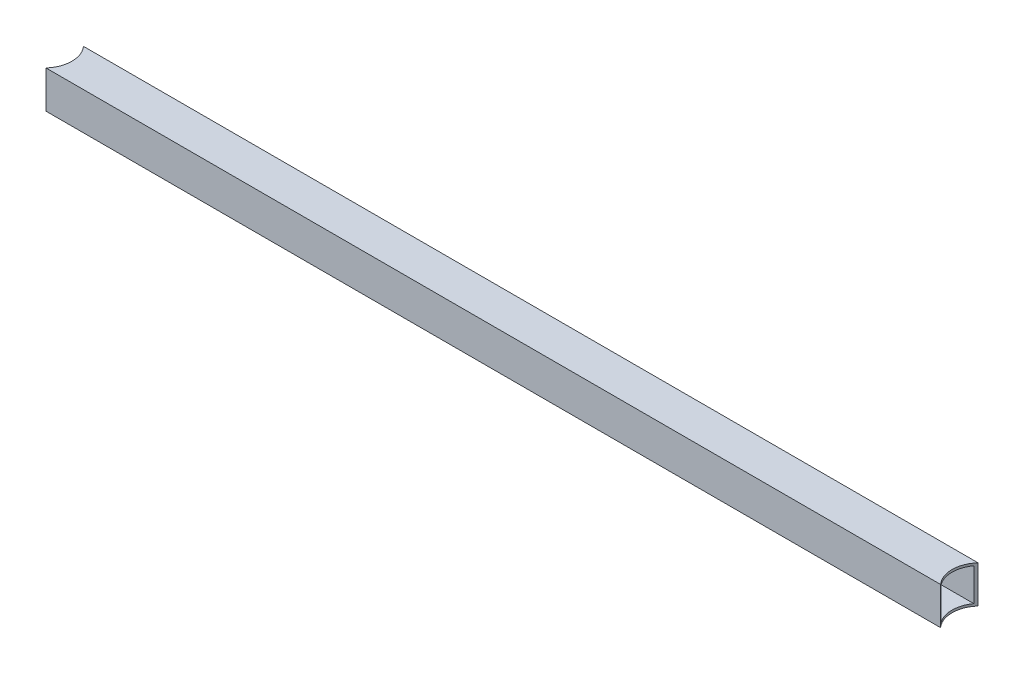
ISO-10303-21;
HEADER;
FILE_DESCRIPTION(('STEP AP214'),'2;1');
FILE_NAME('part.step','',(''),(''),'','','');
FILE_SCHEMA(('AUTOMOTIVE_DESIGN { 1 0 10303 214 1 1 1 1 }'));
ENDSEC;
DATA;
#1=APPLICATION_CONTEXT('core data for automotive mechanical design processes');
#2=APPLICATION_PROTOCOL_DEFINITION('international standard','automotive_design',2000,#1);
#3=PRODUCT_CONTEXT('',#1,'mechanical');
#4=PRODUCT('Part','Part','',(#3));
#5=PRODUCT_RELATED_PRODUCT_CATEGORY('part','',(#4));
#6=PRODUCT_DEFINITION_FORMATION('','',#4);
#7=PRODUCT_DEFINITION_CONTEXT('part definition',#1,'design');
#8=PRODUCT_DEFINITION('design','',#6,#7);
#9=PRODUCT_DEFINITION_SHAPE('','',#8);
#10=(LENGTH_UNIT() NAMED_UNIT(*) SI_UNIT(.MILLI.,.METRE.));
#11=(NAMED_UNIT(*) PLANE_ANGLE_UNIT() SI_UNIT($,.RADIAN.));
#12=(NAMED_UNIT(*) SI_UNIT($,.STERADIAN.) SOLID_ANGLE_UNIT());
#13=UNCERTAINTY_MEASURE_WITH_UNIT(LENGTH_MEASURE(1.E-05),#10,'distance_accuracy_value','');
#14=(GEOMETRIC_REPRESENTATION_CONTEXT(3) GLOBAL_UNCERTAINTY_ASSIGNED_CONTEXT((#13)) GLOBAL_UNIT_ASSIGNED_CONTEXT((#10,
#11,#12)) REPRESENTATION_CONTEXT('',''));
#15=CARTESIAN_POINT('',(0.,0.,0.));
#16=DIRECTION('',(0.,0.,1.));
#17=DIRECTION('',(1.,0.,0.));
#18=AXIS2_PLACEMENT_3D('',#15,#16,#17);
#19=CARTESIAN_POINT('',(635.,23.8125,-1.5875));
#20=DIRECTION('',(0.,-1.,0.));
#21=DIRECTION('',(0.,0.,-1.));
#22=AXIS2_PLACEMENT_3D('',#19,#20,#21);
#23=PLANE('',#22);
#24=CARTESIAN_POINT('',(0.,23.8125,-12.7));
#25=DIRECTION('',(0.,-1.,0.));
#26=DIRECTION('',(0.,0.,-1.));
#27=AXIS2_PLACEMENT_3D('',#24,#25,#26);
#28=CIRCLE('',#27,19.05);
#29=CARTESIAN_POINT('',(15.4730360223842,23.8125,-23.8125));
#30=VERTEX_POINT('',#29);
#31=CARTESIAN_POINT('',(15.4730360223842,23.8125,-1.5875));
#32=VERTEX_POINT('',#31);
#33=EDGE_CURVE('E11',#30,#32,#28,.T.);
#34=ORIENTED_EDGE('',*,*,#33,.F.);
#35=DIRECTION('',(-1.,0.,0.));
#36=VECTOR('',#35,1.);
#37=CARTESIAN_POINT('',(635.,23.8125,-23.8125));
#38=LINE('',#37,#36);
#39=CARTESIAN_POINT('',(619.526963977616,23.8125,-23.8125));
#40=VERTEX_POINT('',#39);
#41=EDGE_CURVE('E140',#40,#30,#38,.T.);
#42=ORIENTED_EDGE('',*,*,#41,.F.);
#43=CARTESIAN_POINT('',(635.,23.8125,-12.7));
#44=DIRECTION('',(0.,-1.,0.));
#45=DIRECTION('',(0.,0.,-1.));
#46=AXIS2_PLACEMENT_3D('',#43,#44,#45);
#47=CIRCLE('',#46,19.05);
#48=CARTESIAN_POINT('',(619.526963977616,23.8125,-1.5875));
#49=VERTEX_POINT('',#48);
#50=EDGE_CURVE('E41',#49,#40,#47,.T.);
#51=ORIENTED_EDGE('',*,*,#50,.F.);
#52=DIRECTION('',(-1.,0.,0.));
#53=VECTOR('',#52,1.);
#54=CARTESIAN_POINT('',(635.,23.8125,-1.5875));
#55=LINE('',#54,#53);
#56=EDGE_CURVE('E146',#49,#32,#55,.T.);
#57=ORIENTED_EDGE('',*,*,#56,.T.);
#58=EDGE_LOOP('',(#34,#42,#51,#57));
#59=FACE_BOUND('',#58,.T.);
#60=ADVANCED_FACE('F33',(#59),#23,.T.);
#61=CARTESIAN_POINT('',(635.,1.5875,-23.8125));
#62=DIRECTION('',(0.,0.,1.));
#63=DIRECTION('',(1.,0.,0.));
#64=AXIS2_PLACEMENT_3D('',#61,#62,#63);
#65=PLANE('',#64);
#66=DIRECTION('',(0.,1.,0.));
#67=VECTOR('',#66,1.);
#68=CARTESIAN_POINT('',(15.4730360223842,0.,-23.8125));
#69=LINE('',#68,#67);
#70=CARTESIAN_POINT('',(15.4730360223842,1.5875,-23.8125));
#71=VERTEX_POINT('',#70);
#72=EDGE_CURVE('E166',#71,#30,#69,.T.);
#73=ORIENTED_EDGE('',*,*,#72,.F.);
#74=DIRECTION('',(-1.,0.,0.));
#75=VECTOR('',#74,1.);
#76=CARTESIAN_POINT('',(635.,1.5875,-23.8125));
#77=LINE('',#76,#75);
#78=CARTESIAN_POINT('',(619.526963977616,1.5875,-23.8125));
#79=VERTEX_POINT('',#78);
#80=EDGE_CURVE('E142',#79,#71,#77,.T.);
#81=ORIENTED_EDGE('',*,*,#80,.F.);
#82=DIRECTION('',(0.,1.,0.));
#83=VECTOR('',#82,1.);
#84=CARTESIAN_POINT('',(619.526963977616,0.,-23.8125));
#85=LINE('',#84,#83);
#86=EDGE_CURVE('E128',#40,#79,#85,.F.);
#87=ORIENTED_EDGE('',*,*,#86,.F.);
#88=ORIENTED_EDGE('',*,*,#41,.T.);
#89=EDGE_LOOP('',(#73,#81,#87,#88));
#90=FACE_BOUND('',#89,.T.);
#91=ADVANCED_FACE('F139',(#90),#65,.T.);
#92=CARTESIAN_POINT('',(635.,1.5875,-1.5875));
#93=DIRECTION('',(0.,1.,0.));
#94=DIRECTION('',(0.,0.,1.));
#95=AXIS2_PLACEMENT_3D('',#92,#93,#94);
#96=PLANE('',#95);
#97=CARTESIAN_POINT('',(0.,1.5875,-12.7));
#98=DIRECTION('',(0.,1.,0.));
#99=DIRECTION('',(0.,0.,1.));
#100=AXIS2_PLACEMENT_3D('',#97,#98,#99);
#101=CIRCLE('',#100,19.05);
#102=CARTESIAN_POINT('',(15.4730360223842,1.5875,-1.5875));
#103=VERTEX_POINT('',#102);
#104=EDGE_CURVE('E168',#103,#71,#101,.T.);
#105=ORIENTED_EDGE('',*,*,#104,.F.);
#106=DIRECTION('',(-1.,0.,0.));
#107=VECTOR('',#106,1.);
#108=CARTESIAN_POINT('',(635.,1.5875,-1.5875));
#109=LINE('',#108,#107);
#110=CARTESIAN_POINT('',(619.526963977616,1.5875,-1.5875));
#111=VERTEX_POINT('',#110);
#112=EDGE_CURVE('E148',#111,#103,#109,.T.);
#113=ORIENTED_EDGE('',*,*,#112,.F.);
#114=CARTESIAN_POINT('',(635.,1.5875,-12.7));
#115=DIRECTION('',(0.,1.,0.));
#116=DIRECTION('',(0.,0.,1.));
#117=AXIS2_PLACEMENT_3D('',#114,#115,#116);
#118=CIRCLE('',#117,19.05);
#119=EDGE_CURVE('E143',#79,#111,#118,.T.);
#120=ORIENTED_EDGE('',*,*,#119,.F.);
#121=ORIENTED_EDGE('',*,*,#80,.T.);
#122=EDGE_LOOP('',(#105,#113,#120,#121));
#123=FACE_BOUND('',#122,.T.);
#124=ADVANCED_FACE('F188',(#123),#96,.T.);
#125=CARTESIAN_POINT('',(635.,1.5875,-1.5875));
#126=DIRECTION('',(0.,0.,-1.));
#127=DIRECTION('',(-1.,0.,0.));
#128=AXIS2_PLACEMENT_3D('',#125,#126,#127);
#129=PLANE('',#128);
#130=DIRECTION('',(0.,1.,0.));
#131=VECTOR('',#130,1.);
#132=CARTESIAN_POINT('',(15.4730360223842,0.,-1.5875));
#133=LINE('',#132,#131);
#134=EDGE_CURVE('E170',#32,#103,#133,.F.);
#135=ORIENTED_EDGE('',*,*,#134,.F.);
#136=ORIENTED_EDGE('',*,*,#56,.F.);
#137=DIRECTION('',(0.,1.,0.));
#138=VECTOR('',#137,1.);
#139=CARTESIAN_POINT('',(619.526963977616,0.,-1.5875));
#140=LINE('',#139,#138);
#141=EDGE_CURVE('E114',#111,#49,#140,.T.);
#142=ORIENTED_EDGE('',*,*,#141,.F.);
#143=ORIENTED_EDGE('',*,*,#112,.T.);
#144=EDGE_LOOP('',(#135,#136,#142,#143));
#145=FACE_BOUND('',#144,.T.);
#146=ADVANCED_FACE('F181',(#145),#129,.T.);
#147=CARTESIAN_POINT('',(635.,0.,-12.7));
#148=DIRECTION('',(0.,1.,0.));
#149=DIRECTION('',(0.,0.,1.));
#150=AXIS2_PLACEMENT_3D('',#147,#148,#149);
#151=CYLINDRICAL_SURFACE('',#150,19.05);
#152=ORIENTED_EDGE('',*,*,#141,.T.);
#153=ORIENTED_EDGE('',*,*,#50,.T.);
#154=ORIENTED_EDGE('',*,*,#86,.T.);
#155=ORIENTED_EDGE('',*,*,#119,.T.);
#156=EDGE_LOOP('',(#152,#153,#154,#155));
#157=FACE_BOUND('',#156,.T.);
#158=CARTESIAN_POINT('',(635.,0.,-12.7));
#159=DIRECTION('',(0.,1.,0.));
#160=DIRECTION('',(0.,0.,1.));
#161=AXIS2_PLACEMENT_3D('',#158,#159,#160);
#162=CIRCLE('',#161,19.05);
#163=CARTESIAN_POINT('',(620.800968342876,0.,-25.4));
#164=VERTEX_POINT('',#163);
#165=CARTESIAN_POINT('',(620.800968342876,0.,0.));
#166=VERTEX_POINT('',#165);
#167=EDGE_CURVE('E95',#164,#166,#162,.T.);
#168=ORIENTED_EDGE('',*,*,#167,.F.);
#169=DIRECTION('',(0.,1.,0.));
#170=VECTOR('',#169,1.);
#171=CARTESIAN_POINT('',(620.800968342876,0.,-25.4));
#172=LINE('',#171,#170);
#173=CARTESIAN_POINT('',(620.800968342876,25.4,-25.4));
#174=VERTEX_POINT('',#173);
#175=EDGE_CURVE('E48',#174,#164,#172,.F.);
#176=ORIENTED_EDGE('',*,*,#175,.F.);
#177=CARTESIAN_POINT('',(635.,25.4,-12.7));
#178=DIRECTION('',(0.,1.,0.));
#179=DIRECTION('',(0.,0.,1.));
#180=AXIS2_PLACEMENT_3D('',#177,#178,#179);
#181=CIRCLE('',#180,19.05);
#182=CARTESIAN_POINT('',(620.800968342876,25.4,0.));
#183=VERTEX_POINT('',#182);
#184=EDGE_CURVE('E104',#174,#183,#181,.T.);
#185=ORIENTED_EDGE('',*,*,#184,.T.);
#186=DIRECTION('',(0.,1.,0.));
#187=VECTOR('',#186,1.);
#188=CARTESIAN_POINT('',(620.800968342876,0.,0.));
#189=LINE('',#188,#187);
#190=EDGE_CURVE('E98',#166,#183,#189,.T.);
#191=ORIENTED_EDGE('',*,*,#190,.F.);
#192=EDGE_LOOP('',(#168,#176,#185,#191));
#193=FACE_BOUND('',#192,.T.);
#194=ADVANCED_FACE('F96',(#157,#193),#151,.F.);
#195=CARTESIAN_POINT('',(0.,0.,-12.7));
#196=DIRECTION('',(0.,1.,0.));
#197=DIRECTION('',(0.,0.,1.));
#198=AXIS2_PLACEMENT_3D('',#195,#196,#197);
#199=CYLINDRICAL_SURFACE('',#198,19.05);
#200=ORIENTED_EDGE('',*,*,#134,.T.);
#201=ORIENTED_EDGE('',*,*,#104,.T.);
#202=ORIENTED_EDGE('',*,*,#72,.T.);
#203=ORIENTED_EDGE('',*,*,#33,.T.);
#204=EDGE_LOOP('',(#200,#201,#202,#203));
#205=FACE_BOUND('',#204,.T.);
#206=CARTESIAN_POINT('',(0.,25.4,-12.7));
#207=DIRECTION('',(0.,1.,0.));
#208=DIRECTION('',(0.,0.,1.));
#209=AXIS2_PLACEMENT_3D('',#206,#207,#208);
#210=CIRCLE('',#209,19.05);
#211=CARTESIAN_POINT('',(14.1990316571237,25.4,0.));
#212=VERTEX_POINT('',#211);
#213=CARTESIAN_POINT('',(14.1990316571237,25.4,-25.4));
#214=VERTEX_POINT('',#213);
#215=EDGE_CURVE('E103',#212,#214,#210,.T.);
#216=ORIENTED_EDGE('',*,*,#215,.T.);
#217=DIRECTION('',(0.,1.,0.));
#218=VECTOR('',#217,1.);
#219=CARTESIAN_POINT('',(14.1990316571237,0.,-25.4));
#220=LINE('',#219,#218);
#221=CARTESIAN_POINT('',(14.1990316571237,0.,-25.4));
#222=VERTEX_POINT('',#221);
#223=EDGE_CURVE('E172',#222,#214,#220,.T.);
#224=ORIENTED_EDGE('',*,*,#223,.F.);
#225=CARTESIAN_POINT('',(0.,0.,-12.7));
#226=DIRECTION('',(0.,1.,0.));
#227=DIRECTION('',(0.,0.,1.));
#228=AXIS2_PLACEMENT_3D('',#225,#226,#227);
#229=CIRCLE('',#228,19.05);
#230=CARTESIAN_POINT('',(14.1990316571237,0.,0.));
#231=VERTEX_POINT('',#230);
#232=EDGE_CURVE('E118',#231,#222,#229,.T.);
#233=ORIENTED_EDGE('',*,*,#232,.F.);
#234=DIRECTION('',(0.,1.,0.));
#235=VECTOR('',#234,1.);
#236=CARTESIAN_POINT('',(14.1990316571237,0.,0.));
#237=LINE('',#236,#235);
#238=EDGE_CURVE('E56',#212,#231,#237,.F.);
#239=ORIENTED_EDGE('',*,*,#238,.F.);
#240=EDGE_LOOP('',(#216,#224,#233,#239));
#241=FACE_BOUND('',#240,.T.);
#242=ADVANCED_FACE('F173',(#205,#241),#199,.F.);
#243=CARTESIAN_POINT('',(635.,0.,0.));
#244=DIRECTION('',(0.,0.,-1.));
#245=DIRECTION('',(-1.,0.,0.));
#246=AXIS2_PLACEMENT_3D('',#243,#244,#245);
#247=PLANE('',#246);
#248=DIRECTION('',(-1.,0.,0.));
#249=VECTOR('',#248,1.);
#250=CARTESIAN_POINT('',(635.,25.4,0.));
#251=LINE('',#250,#249);
#252=EDGE_CURVE('E122',#183,#212,#251,.T.);
#253=ORIENTED_EDGE('',*,*,#252,.T.);
#254=ORIENTED_EDGE('',*,*,#238,.T.);
#255=DIRECTION('',(-1.,0.,0.));
#256=VECTOR('',#255,1.);
#257=CARTESIAN_POINT('',(635.,0.,0.));
#258=LINE('',#257,#256);
#259=EDGE_CURVE('E119',#166,#231,#258,.T.);
#260=ORIENTED_EDGE('',*,*,#259,.F.);
#261=ORIENTED_EDGE('',*,*,#190,.T.);
#262=EDGE_LOOP('',(#253,#254,#260,#261));
#263=FACE_BOUND('',#262,.T.);
#264=ADVANCED_FACE('F35',(#263),#247,.F.);
#265=CARTESIAN_POINT('',(635.,0.,0.));
#266=DIRECTION('',(0.,1.,0.));
#267=DIRECTION('',(0.,0.,1.));
#268=AXIS2_PLACEMENT_3D('',#265,#266,#267);
#269=PLANE('',#268);
#270=ORIENTED_EDGE('',*,*,#259,.T.);
#271=ORIENTED_EDGE('',*,*,#232,.T.);
#272=DIRECTION('',(-1.,0.,0.));
#273=VECTOR('',#272,1.);
#274=CARTESIAN_POINT('',(635.,0.,-25.4));
#275=LINE('',#274,#273);
#276=EDGE_CURVE('E111',#164,#222,#275,.T.);
#277=ORIENTED_EDGE('',*,*,#276,.F.);
#278=ORIENTED_EDGE('',*,*,#167,.T.);
#279=EDGE_LOOP('',(#270,#271,#277,#278));
#280=FACE_BOUND('',#279,.T.);
#281=ADVANCED_FACE('F117',(#280),#269,.F.);
#282=CARTESIAN_POINT('',(635.,0.,-25.4));
#283=DIRECTION('',(0.,0.,1.));
#284=DIRECTION('',(1.,0.,0.));
#285=AXIS2_PLACEMENT_3D('',#282,#283,#284);
#286=PLANE('',#285);
#287=ORIENTED_EDGE('',*,*,#276,.T.);
#288=ORIENTED_EDGE('',*,*,#223,.T.);
#289=DIRECTION('',(-1.,0.,0.));
#290=VECTOR('',#289,1.);
#291=CARTESIAN_POINT('',(635.,25.4,-25.4));
#292=LINE('',#291,#290);
#293=EDGE_CURVE('E113',#174,#214,#292,.T.);
#294=ORIENTED_EDGE('',*,*,#293,.F.);
#295=ORIENTED_EDGE('',*,*,#175,.T.);
#296=EDGE_LOOP('',(#287,#288,#294,#295));
#297=FACE_BOUND('',#296,.T.);
#298=ADVANCED_FACE('F109',(#297),#286,.F.);
#299=CARTESIAN_POINT('',(635.,25.4,0.));
#300=DIRECTION('',(0.,-1.,0.));
#301=DIRECTION('',(0.,0.,-1.));
#302=AXIS2_PLACEMENT_3D('',#299,#300,#301);
#303=PLANE('',#302);
#304=ORIENTED_EDGE('',*,*,#293,.T.);
#305=ORIENTED_EDGE('',*,*,#215,.F.);
#306=ORIENTED_EDGE('',*,*,#252,.F.);
#307=ORIENTED_EDGE('',*,*,#184,.F.);
#308=EDGE_LOOP('',(#304,#305,#306,#307));
#309=FACE_BOUND('',#308,.T.);
#310=ADVANCED_FACE('F158',(#309),#303,.F.);
#311=CLOSED_SHELL('',(#60,#91,#124,#146,#194,#242,#264,#281,#298,#310));
#312=MANIFOLD_SOLID_BREP('B2',#311);
#313=ADVANCED_BREP_SHAPE_REPRESENTATION('',(#18,#312),#14);
#314=SHAPE_DEFINITION_REPRESENTATION(#9,#313);
ENDSEC;
END-ISO-10303-21;
